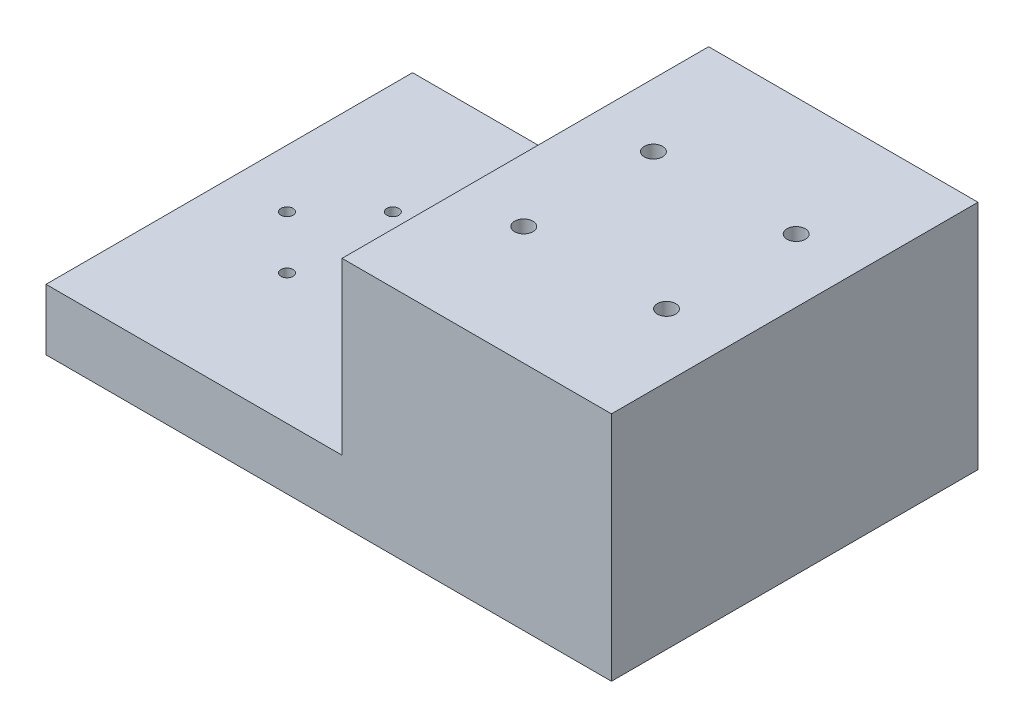
ISO-10303-21;
HEADER;
FILE_DESCRIPTION(('STEP AP214'),'2;1');
FILE_NAME('part.step','',(''),(''),'','','');
FILE_SCHEMA(('AUTOMOTIVE_DESIGN { 1 0 10303 214 1 1 1 1 }'));
ENDSEC;
DATA;
#1=APPLICATION_CONTEXT('core data for automotive mechanical design processes');
#2=APPLICATION_PROTOCOL_DEFINITION('international standard','automotive_design',2000,#1);
#3=PRODUCT_CONTEXT('',#1,'mechanical');
#4=PRODUCT('Part','Part','',(#3));
#5=PRODUCT_RELATED_PRODUCT_CATEGORY('part','',(#4));
#6=PRODUCT_DEFINITION_FORMATION('','',#4);
#7=PRODUCT_DEFINITION_CONTEXT('part definition',#1,'design');
#8=PRODUCT_DEFINITION('design','',#6,#7);
#9=PRODUCT_DEFINITION_SHAPE('','',#8);
#10=(LENGTH_UNIT() NAMED_UNIT(*) SI_UNIT(.MILLI.,.METRE.));
#11=(NAMED_UNIT(*) PLANE_ANGLE_UNIT() SI_UNIT($,.RADIAN.));
#12=(NAMED_UNIT(*) SI_UNIT($,.STERADIAN.) SOLID_ANGLE_UNIT());
#13=UNCERTAINTY_MEASURE_WITH_UNIT(LENGTH_MEASURE(1.E-05),#10,'distance_accuracy_value','');
#14=(GEOMETRIC_REPRESENTATION_CONTEXT(3) GLOBAL_UNCERTAINTY_ASSIGNED_CONTEXT((#13)) GLOBAL_UNIT_ASSIGNED_CONTEXT((#10,
#11,#12)) REPRESENTATION_CONTEXT('',''));
#15=CARTESIAN_POINT('',(0.,0.,0.));
#16=DIRECTION('',(0.,0.,1.));
#17=DIRECTION('',(1.,0.,0.));
#18=AXIS2_PLACEMENT_3D('',#15,#16,#17);
#19=CARTESIAN_POINT('',(0.,48.7038541550246,0.));
#20=DIRECTION('',(0.,1.,0.));
#21=DIRECTION('',(0.,0.,1.));
#22=AXIS2_PLACEMENT_3D('',#19,#20,#21);
#23=PLANE('',#22);
#24=CARTESIAN_POINT('',(104.375,48.7038541550246,13.4747));
#25=DIRECTION('',(0.,1.,0.));
#26=DIRECTION('',(0.,0.,1.));
#27=AXIS2_PLACEMENT_3D('',#24,#25,#26);
#28=CIRCLE('',#27,1.90500000000001);
#29=CARTESIAN_POINT('',(104.375,48.7038541550246,15.3797));
#30=VERTEX_POINT('',#29);
#31=EDGE_CURVE('E221',#30,#30,#28,.F.);
#32=ORIENTED_EDGE('',*,*,#31,.T.);
#33=EDGE_LOOP('',(#32));
#34=FACE_BOUND('',#33,.T.);
#35=CARTESIAN_POINT('',(74.695,48.7038541550246,-13.4747));
#36=DIRECTION('',(0.,1.,0.));
#37=DIRECTION('',(0.,0.,1.));
#38=AXIS2_PLACEMENT_3D('',#35,#36,#37);
#39=CIRCLE('',#38,1.90500000000001);
#40=CARTESIAN_POINT('',(74.695,48.7038541550246,-11.5697));
#41=VERTEX_POINT('',#40);
#42=EDGE_CURVE('E239',#41,#41,#39,.T.);
#43=ORIENTED_EDGE('',*,*,#42,.F.);
#44=EDGE_LOOP('',(#43));
#45=FACE_BOUND('',#44,.T.);
#46=CARTESIAN_POINT('',(104.375,48.7038541550246,-13.4747));
#47=DIRECTION('',(0.,1.,0.));
#48=DIRECTION('',(0.,0.,1.));
#49=AXIS2_PLACEMENT_3D('',#46,#47,#48);
#50=CIRCLE('',#49,1.90500000000001);
#51=CARTESIAN_POINT('',(104.375,48.7038541550246,-11.5697));
#52=VERTEX_POINT('',#51);
#53=EDGE_CURVE('E245',#52,#52,#50,.T.);
#54=ORIENTED_EDGE('',*,*,#53,.F.);
#55=EDGE_LOOP('',(#54));
#56=FACE_BOUND('',#55,.T.);
#57=DIRECTION('',(0.,0.,-1.));
#58=VECTOR('',#57,1.);
#59=CARTESIAN_POINT('',(117.55,48.7038541550246,38.1));
#60=LINE('',#59,#58);
#61=CARTESIAN_POINT('',(117.55,48.7038541550246,38.1));
#62=VERTEX_POINT('',#61);
#63=CARTESIAN_POINT('',(117.55,48.7038541550246,-38.1));
#64=VERTEX_POINT('',#63);
#65=EDGE_CURVE('E120',#62,#64,#60,.T.);
#66=ORIENTED_EDGE('',*,*,#65,.T.);
#67=DIRECTION('',(-1.,0.,0.));
#68=VECTOR('',#67,1.);
#69=CARTESIAN_POINT('',(117.55,48.7038541550246,-38.1));
#70=LINE('',#69,#68);
#71=CARTESIAN_POINT('',(61.55,48.7038541550246,-38.1));
#72=VERTEX_POINT('',#71);
#73=EDGE_CURVE('E161',#64,#72,#70,.T.);
#74=ORIENTED_EDGE('',*,*,#73,.T.);
#75=DIRECTION('',(0.,0.,1.));
#76=VECTOR('',#75,1.);
#77=CARTESIAN_POINT('',(61.55,48.7038541550246,38.1));
#78=LINE('',#77,#76);
#79=CARTESIAN_POINT('',(61.55,48.7038541550246,38.1));
#80=VERTEX_POINT('',#79);
#81=EDGE_CURVE('E167',#72,#80,#78,.T.);
#82=ORIENTED_EDGE('',*,*,#81,.T.);
#83=DIRECTION('',(1.,0.,0.));
#84=VECTOR('',#83,1.);
#85=CARTESIAN_POINT('',(117.55,48.7038541550246,38.1));
#86=LINE('',#85,#84);
#87=EDGE_CURVE('E126',#80,#62,#86,.T.);
#88=ORIENTED_EDGE('',*,*,#87,.T.);
#89=EDGE_LOOP('',(#66,#74,#82,#88));
#90=FACE_BOUND('',#89,.T.);
#91=CARTESIAN_POINT('',(74.695,48.7038541550246,13.4747));
#92=DIRECTION('',(0.,1.,0.));
#93=DIRECTION('',(0.,0.,1.));
#94=AXIS2_PLACEMENT_3D('',#91,#92,#93);
#95=CIRCLE('',#94,1.90500000000001);
#96=CARTESIAN_POINT('',(74.695,48.7038541550246,15.3797));
#97=VERTEX_POINT('',#96);
#98=EDGE_CURVE('E215',#97,#97,#95,.F.);
#99=ORIENTED_EDGE('',*,*,#98,.T.);
#100=EDGE_LOOP('',(#99));
#101=FACE_BOUND('',#100,.T.);
#102=ADVANCED_FACE('F35',(#34,#45,#56,#90,#101),#23,.T.);
#103=CARTESIAN_POINT('',(74.695,25.0538541550246,13.4747));
#104=DIRECTION('',(0.,1.,0.));
#105=DIRECTION('',(0.,0.,-1.));
#106=AXIS2_PLACEMENT_3D('',#103,#104,#105);
#107=PLANE('',#106);
#108=CARTESIAN_POINT('',(74.695,25.0538541550246,13.4747));
#109=DIRECTION('',(0.,-1.,0.));
#110=DIRECTION('',(0.,0.,-1.));
#111=AXIS2_PLACEMENT_3D('',#108,#109,#110);
#112=CIRCLE('',#111,3.75000000000001);
#113=CARTESIAN_POINT('',(74.695,25.0538541550246,9.72470000000001));
#114=VERTEX_POINT('',#113);
#115=EDGE_CURVE('E225',#114,#114,#112,.T.);
#116=ORIENTED_EDGE('',*,*,#115,.T.);
#117=EDGE_LOOP('',(#116));
#118=FACE_BOUND('',#117,.T.);
#119=CARTESIAN_POINT('',(74.695,25.0538541550246,13.4747));
#120=DIRECTION('',(0.,1.,0.));
#121=DIRECTION('',(0.,0.,1.));
#122=AXIS2_PLACEMENT_3D('',#119,#120,#121);
#123=CIRCLE('',#122,1.90500000000001);
#124=CARTESIAN_POINT('',(74.695,25.0538541550246,15.3797));
#125=VERTEX_POINT('',#124);
#126=EDGE_CURVE('E212',#125,#125,#123,.T.);
#127=ORIENTED_EDGE('',*,*,#126,.T.);
#128=EDGE_LOOP('',(#127));
#129=FACE_BOUND('',#128,.T.);
#130=ADVANCED_FACE('F277',(#118,#129),#107,.F.);
#131=CARTESIAN_POINT('',(104.375,25.0538541550246,13.4747));
#132=DIRECTION('',(0.,1.,0.));
#133=DIRECTION('',(0.,0.,-1.));
#134=AXIS2_PLACEMENT_3D('',#131,#132,#133);
#135=PLANE('',#134);
#136=CARTESIAN_POINT('',(104.375,25.0538541550246,13.4747));
#137=DIRECTION('',(0.,-1.,0.));
#138=DIRECTION('',(0.,0.,-1.));
#139=AXIS2_PLACEMENT_3D('',#136,#137,#138);
#140=CIRCLE('',#139,3.75000000000001);
#141=CARTESIAN_POINT('',(104.375,25.0538541550246,9.72470000000001));
#142=VERTEX_POINT('',#141);
#143=EDGE_CURVE('E231',#142,#142,#140,.T.);
#144=ORIENTED_EDGE('',*,*,#143,.T.);
#145=EDGE_LOOP('',(#144));
#146=FACE_BOUND('',#145,.T.);
#147=CARTESIAN_POINT('',(104.375,25.0538541550246,13.4747));
#148=DIRECTION('',(0.,1.,0.));
#149=DIRECTION('',(0.,0.,1.));
#150=AXIS2_PLACEMENT_3D('',#147,#148,#149);
#151=CIRCLE('',#150,1.90500000000001);
#152=CARTESIAN_POINT('',(104.375,25.0538541550246,15.3797));
#153=VERTEX_POINT('',#152);
#154=EDGE_CURVE('E218',#153,#153,#151,.T.);
#155=ORIENTED_EDGE('',*,*,#154,.T.);
#156=EDGE_LOOP('',(#155));
#157=FACE_BOUND('',#156,.T.);
#158=ADVANCED_FACE('F282',(#146,#157),#135,.F.);
#159=CARTESIAN_POINT('',(117.55,0.553854155024559,38.1));
#160=DIRECTION('',(0.,1.,0.));
#161=DIRECTION('',(0.,0.,1.));
#162=AXIS2_PLACEMENT_3D('',#159,#160,#161);
#163=PLANE('',#162);
#164=CARTESIAN_POINT('',(74.695,0.553854155024559,13.4747));
#165=DIRECTION('',(0.,-1.,0.));
#166=DIRECTION('',(0.,0.,-1.));
#167=AXIS2_PLACEMENT_3D('',#164,#165,#166);
#168=CIRCLE('',#167,3.75000000000001);
#169=CARTESIAN_POINT('',(74.695,0.553854155024559,9.72470000000001));
#170=VERTEX_POINT('',#169);
#171=EDGE_CURVE('E224',#170,#170,#168,.T.);
#172=ORIENTED_EDGE('',*,*,#171,.F.);
#173=EDGE_LOOP('',(#172));
#174=FACE_BOUND('',#173,.T.);
#175=CARTESIAN_POINT('',(104.375,0.553854155024559,13.4747));
#176=DIRECTION('',(0.,-1.,0.));
#177=DIRECTION('',(0.,0.,-1.));
#178=AXIS2_PLACEMENT_3D('',#175,#176,#177);
#179=CIRCLE('',#178,3.75000000000001);
#180=CARTESIAN_POINT('',(104.375,0.553854155024559,9.72470000000001));
#181=VERTEX_POINT('',#180);
#182=EDGE_CURVE('E228',#181,#181,#179,.T.);
#183=ORIENTED_EDGE('',*,*,#182,.F.);
#184=EDGE_LOOP('',(#183));
#185=FACE_BOUND('',#184,.T.);
#186=CARTESIAN_POINT('',(104.375,0.553854155024559,-13.4747));
#187=DIRECTION('',(0.,1.,0.));
#188=DIRECTION('',(0.,0.,1.));
#189=AXIS2_PLACEMENT_3D('',#186,#187,#188);
#190=CIRCLE('',#189,3.75000000000001);
#191=CARTESIAN_POINT('',(104.375,0.553854155024559,-9.72470000000001));
#192=VERTEX_POINT('',#191);
#193=EDGE_CURVE('E173',#192,#192,#190,.T.);
#194=ORIENTED_EDGE('',*,*,#193,.T.);
#195=EDGE_LOOP('',(#194));
#196=FACE_BOUND('',#195,.T.);
#197=CARTESIAN_POINT('',(12.,0.553854155024559,0.));
#198=DIRECTION('',(0.,1.,0.));
#199=DIRECTION('',(0.,0.,1.));
#200=AXIS2_PLACEMENT_3D('',#197,#198,#199);
#201=CIRCLE('',#200,1.25);
#202=CARTESIAN_POINT('',(12.,0.553854155024559,1.25));
#203=VERTEX_POINT('',#202);
#204=EDGE_CURVE('E131',#203,#203,#201,.T.);
#205=ORIENTED_EDGE('',*,*,#204,.T.);
#206=EDGE_LOOP('',(#205));
#207=FACE_BOUND('',#206,.T.);
#208=CARTESIAN_POINT('',(34.,0.553854155024559,0.));
#209=DIRECTION('',(0.,1.,0.));
#210=DIRECTION('',(0.,0.,1.));
#211=AXIS2_PLACEMENT_3D('',#208,#209,#210);
#212=CIRCLE('',#211,1.25);
#213=CARTESIAN_POINT('',(34.,0.553854155024559,1.25));
#214=VERTEX_POINT('',#213);
#215=EDGE_CURVE('E138',#214,#214,#212,.T.);
#216=ORIENTED_EDGE('',*,*,#215,.T.);
#217=EDGE_LOOP('',(#216));
#218=FACE_BOUND('',#217,.T.);
#219=CARTESIAN_POINT('',(23.,0.553854155024559,11.));
#220=DIRECTION('',(0.,1.,0.));
#221=DIRECTION('',(0.,0.,1.));
#222=AXIS2_PLACEMENT_3D('',#219,#220,#221);
#223=CIRCLE('',#222,1.25);
#224=CARTESIAN_POINT('',(23.,0.553854155024559,12.25));
#225=VERTEX_POINT('',#224);
#226=EDGE_CURVE('E144',#225,#225,#223,.T.);
#227=ORIENTED_EDGE('',*,*,#226,.T.);
#228=EDGE_LOOP('',(#227));
#229=FACE_BOUND('',#228,.T.);
#230=CARTESIAN_POINT('',(23.,0.553854155024559,-11.));
#231=DIRECTION('',(0.,1.,0.));
#232=DIRECTION('',(0.,0.,1.));
#233=AXIS2_PLACEMENT_3D('',#230,#231,#232);
#234=CIRCLE('',#233,1.25);
#235=CARTESIAN_POINT('',(23.,0.553854155024559,-9.75));
#236=VERTEX_POINT('',#235);
#237=EDGE_CURVE('E102',#236,#236,#234,.T.);
#238=ORIENTED_EDGE('',*,*,#237,.T.);
#239=EDGE_LOOP('',(#238));
#240=FACE_BOUND('',#239,.T.);
#241=DIRECTION('',(0.,0.,-1.));
#242=VECTOR('',#241,1.);
#243=CARTESIAN_POINT('',(0.,0.553854155024559,38.1));
#244=LINE('',#243,#242);
#245=CARTESIAN_POINT('',(0.,0.553854155024559,38.1));
#246=VERTEX_POINT('',#245);
#247=CARTESIAN_POINT('',(0.,0.553854155024559,-38.1));
#248=VERTEX_POINT('',#247);
#249=EDGE_CURVE('E101',#246,#248,#244,.T.);
#250=ORIENTED_EDGE('',*,*,#249,.T.);
#251=DIRECTION('',(-1.,0.,0.));
#252=VECTOR('',#251,1.);
#253=CARTESIAN_POINT('',(117.55,0.553854155024559,-38.1));
#254=LINE('',#253,#252);
#255=CARTESIAN_POINT('',(117.55,0.553854155024559,-38.1));
#256=VERTEX_POINT('',#255);
#257=EDGE_CURVE('E44',#256,#248,#254,.T.);
#258=ORIENTED_EDGE('',*,*,#257,.F.);
#259=DIRECTION('',(0.,0.,-1.));
#260=VECTOR('',#259,1.);
#261=CARTESIAN_POINT('',(117.55,0.553854155024559,38.1));
#262=LINE('',#261,#260);
#263=CARTESIAN_POINT('',(117.55,0.553854155024559,38.1));
#264=VERTEX_POINT('',#263);
#265=EDGE_CURVE('E61',#264,#256,#262,.T.);
#266=ORIENTED_EDGE('',*,*,#265,.F.);
#267=DIRECTION('',(-1.,0.,0.));
#268=VECTOR('',#267,1.);
#269=CARTESIAN_POINT('',(117.55,0.553854155024559,38.1));
#270=LINE('',#269,#268);
#271=EDGE_CURVE('E12',#264,#246,#270,.T.);
#272=ORIENTED_EDGE('',*,*,#271,.T.);
#273=EDGE_LOOP('',(#250,#258,#266,#272));
#274=FACE_BOUND('',#273,.T.);
#275=CARTESIAN_POINT('',(74.695,0.553854155024559,-13.4747));
#276=DIRECTION('',(0.,1.,0.));
#277=DIRECTION('',(0.,0.,1.));
#278=AXIS2_PLACEMENT_3D('',#275,#276,#277);
#279=CIRCLE('',#278,3.75000000000001);
#280=CARTESIAN_POINT('',(74.695,0.553854155024559,-9.72470000000001));
#281=VERTEX_POINT('',#280);
#282=EDGE_CURVE('E248',#281,#281,#279,.T.);
#283=ORIENTED_EDGE('',*,*,#282,.T.);
#284=EDGE_LOOP('',(#283));
#285=FACE_BOUND('',#284,.T.);
#286=ADVANCED_FACE('F259',(#174,#185,#196,#207,#218,#229,#240,#274,#285),#163,.F.);
#287=CARTESIAN_POINT('',(117.55,13.2538541550246,38.1));
#288=DIRECTION('',(0.,-1.,0.));
#289=DIRECTION('',(0.,0.,-1.));
#290=AXIS2_PLACEMENT_3D('',#287,#288,#289);
#291=PLANE('',#290);
#292=CARTESIAN_POINT('',(23.,13.2538541550246,-11.));
#293=DIRECTION('',(0.,1.,0.));
#294=DIRECTION('',(0.,0.,1.));
#295=AXIS2_PLACEMENT_3D('',#292,#293,#294);
#296=CIRCLE('',#295,1.24999999999999);
#297=CARTESIAN_POINT('',(23.,13.2538541550246,-9.75000000000001));
#298=VERTEX_POINT('',#297);
#299=EDGE_CURVE('E106',#298,#298,#296,.T.);
#300=ORIENTED_EDGE('',*,*,#299,.F.);
#301=EDGE_LOOP('',(#300));
#302=FACE_BOUND('',#301,.T.);
#303=CARTESIAN_POINT('',(23.,13.2538541550246,11.));
#304=DIRECTION('',(0.,1.,0.));
#305=DIRECTION('',(0.,0.,1.));
#306=AXIS2_PLACEMENT_3D('',#303,#304,#305);
#307=CIRCLE('',#306,1.24999999999999);
#308=CARTESIAN_POINT('',(23.,13.2538541550246,12.25));
#309=VERTEX_POINT('',#308);
#310=EDGE_CURVE('E141',#309,#309,#307,.T.);
#311=ORIENTED_EDGE('',*,*,#310,.F.);
#312=EDGE_LOOP('',(#311));
#313=FACE_BOUND('',#312,.T.);
#314=CARTESIAN_POINT('',(34.,13.2538541550246,0.));
#315=DIRECTION('',(0.,1.,0.));
#316=DIRECTION('',(0.,0.,1.));
#317=AXIS2_PLACEMENT_3D('',#314,#315,#316);
#318=CIRCLE('',#317,1.24999999999999);
#319=CARTESIAN_POINT('',(34.,13.2538541550246,1.24999999999999));
#320=VERTEX_POINT('',#319);
#321=EDGE_CURVE('E135',#320,#320,#318,.T.);
#322=ORIENTED_EDGE('',*,*,#321,.F.);
#323=EDGE_LOOP('',(#322));
#324=FACE_BOUND('',#323,.T.);
#325=CARTESIAN_POINT('',(12.,13.2538541550246,0.));
#326=DIRECTION('',(0.,1.,0.));
#327=DIRECTION('',(0.,0.,1.));
#328=AXIS2_PLACEMENT_3D('',#325,#326,#327);
#329=CIRCLE('',#328,1.24999999999999);
#330=CARTESIAN_POINT('',(12.,13.2538541550246,1.24999999999999));
#331=VERTEX_POINT('',#330);
#332=EDGE_CURVE('E128',#331,#331,#329,.T.);
#333=ORIENTED_EDGE('',*,*,#332,.F.);
#334=EDGE_LOOP('',(#333));
#335=FACE_BOUND('',#334,.T.);
#336=DIRECTION('',(0.,0.,1.));
#337=VECTOR('',#336,1.);
#338=CARTESIAN_POINT('',(61.55,13.2538541550246,38.1));
#339=LINE('',#338,#337);
#340=CARTESIAN_POINT('',(61.55,13.2538541550246,-38.1));
#341=VERTEX_POINT('',#340);
#342=CARTESIAN_POINT('',(61.55,13.2538541550246,38.1));
#343=VERTEX_POINT('',#342);
#344=EDGE_CURVE('E52',#341,#343,#339,.T.);
#345=ORIENTED_EDGE('',*,*,#344,.F.);
#346=DIRECTION('',(-1.,0.,0.));
#347=VECTOR('',#346,1.);
#348=CARTESIAN_POINT('',(117.55,13.2538541550246,-38.1));
#349=LINE('',#348,#347);
#350=CARTESIAN_POINT('',(0.,13.2538541550246,-38.1));
#351=VERTEX_POINT('',#350);
#352=EDGE_CURVE('E88',#341,#351,#349,.T.);
#353=ORIENTED_EDGE('',*,*,#352,.T.);
#354=DIRECTION('',(0.,0.,1.));
#355=VECTOR('',#354,1.);
#356=CARTESIAN_POINT('',(0.,13.2538541550246,38.1));
#357=LINE('',#356,#355);
#358=CARTESIAN_POINT('',(0.,13.2538541550246,38.1));
#359=VERTEX_POINT('',#358);
#360=EDGE_CURVE('E92',#351,#359,#357,.T.);
#361=ORIENTED_EDGE('',*,*,#360,.T.);
#362=DIRECTION('',(-1.,0.,0.));
#363=VECTOR('',#362,1.);
#364=CARTESIAN_POINT('',(117.55,13.2538541550246,38.1));
#365=LINE('',#364,#363);
#366=EDGE_CURVE('E79',#343,#359,#365,.T.);
#367=ORIENTED_EDGE('',*,*,#366,.F.);
#368=EDGE_LOOP('',(#345,#353,#361,#367));
#369=FACE_BOUND('',#368,.T.);
#370=ADVANCED_FACE('F93',(#302,#313,#324,#335,#369),#291,.F.);
#371=CARTESIAN_POINT('',(117.55,0.553854155024559,38.1));
#372=DIRECTION('',(0.,0.,-1.));
#373=DIRECTION('',(-1.,0.,0.));
#374=AXIS2_PLACEMENT_3D('',#371,#372,#373);
#375=PLANE('',#374);
#376=DIRECTION('',(0.,-1.,0.));
#377=VECTOR('',#376,1.);
#378=CARTESIAN_POINT('',(0.,0.553854155024559,38.1));
#379=LINE('',#378,#377);
#380=EDGE_CURVE('E83',#359,#246,#379,.T.);
#381=ORIENTED_EDGE('',*,*,#380,.T.);
#382=ORIENTED_EDGE('',*,*,#271,.F.);
#383=DIRECTION('',(0.,-1.,0.));
#384=VECTOR('',#383,1.);
#385=CARTESIAN_POINT('',(117.55,0.553854155024559,38.1));
#386=LINE('',#385,#384);
#387=EDGE_CURVE('E97',#62,#264,#386,.T.);
#388=ORIENTED_EDGE('',*,*,#387,.F.);
#389=ORIENTED_EDGE('',*,*,#87,.F.);
#390=DIRECTION('',(0.,-1.,0.));
#391=VECTOR('',#390,1.);
#392=CARTESIAN_POINT('',(61.55,48.7038541550246,38.1));
#393=LINE('',#392,#391);
#394=EDGE_CURVE('E87',#80,#343,#393,.T.);
#395=ORIENTED_EDGE('',*,*,#394,.T.);
#396=ORIENTED_EDGE('',*,*,#366,.T.);
#397=EDGE_LOOP('',(#381,#382,#388,#389,#395,#396));
#398=FACE_BOUND('',#397,.T.);
#399=ADVANCED_FACE('F37',(#398),#375,.F.);
#400=CARTESIAN_POINT('',(117.55,0.553854155024559,-38.1));
#401=DIRECTION('',(0.,0.,1.));
#402=DIRECTION('',(1.,0.,0.));
#403=AXIS2_PLACEMENT_3D('',#400,#401,#402);
#404=PLANE('',#403);
#405=DIRECTION('',(0.,1.,0.));
#406=VECTOR('',#405,1.);
#407=CARTESIAN_POINT('',(0.,0.553854155024559,-38.1));
#408=LINE('',#407,#406);
#409=EDGE_CURVE('E98',#248,#351,#408,.T.);
#410=ORIENTED_EDGE('',*,*,#409,.T.);
#411=ORIENTED_EDGE('',*,*,#352,.F.);
#412=DIRECTION('',(0.,-1.,0.));
#413=VECTOR('',#412,1.);
#414=CARTESIAN_POINT('',(61.55,48.7038541550246,-38.1));
#415=LINE('',#414,#413);
#416=EDGE_CURVE('E132',#72,#341,#415,.T.);
#417=ORIENTED_EDGE('',*,*,#416,.F.);
#418=ORIENTED_EDGE('',*,*,#73,.F.);
#419=DIRECTION('',(0.,1.,0.));
#420=VECTOR('',#419,1.);
#421=CARTESIAN_POINT('',(117.55,0.553854155024559,-38.1));
#422=LINE('',#421,#420);
#423=EDGE_CURVE('E89',#256,#64,#422,.T.);
#424=ORIENTED_EDGE('',*,*,#423,.F.);
#425=ORIENTED_EDGE('',*,*,#257,.T.);
#426=EDGE_LOOP('',(#410,#411,#417,#418,#424,#425));
#427=FACE_BOUND('',#426,.T.);
#428=ADVANCED_FACE('F162',(#427),#404,.F.);
#429=CARTESIAN_POINT('',(117.55,0.,0.));
#430=DIRECTION('',(-1.,0.,0.));
#431=DIRECTION('',(0.,0.,1.));
#432=AXIS2_PLACEMENT_3D('',#429,#430,#431);
#433=PLANE('',#432);
#434=ORIENTED_EDGE('',*,*,#387,.T.);
#435=ORIENTED_EDGE('',*,*,#265,.T.);
#436=ORIENTED_EDGE('',*,*,#423,.T.);
#437=ORIENTED_EDGE('',*,*,#65,.F.);
#438=EDGE_LOOP('',(#434,#435,#436,#437));
#439=FACE_BOUND('',#438,.T.);
#440=ADVANCED_FACE('F153',(#439),#433,.F.);
#441=CARTESIAN_POINT('',(0.,0.,0.));
#442=DIRECTION('',(-1.,0.,0.));
#443=DIRECTION('',(0.,0.,1.));
#444=AXIS2_PLACEMENT_3D('',#441,#442,#443);
#445=PLANE('',#444);
#446=CARTESIAN_POINT('',(0.,6.90385415502456,-12.7));
#447=DIRECTION('',(-1.,0.,0.));
#448=DIRECTION('',(0.,0.,1.));
#449=AXIS2_PLACEMENT_3D('',#446,#447,#448);
#450=CIRCLE('',#449,1.02499999999999);
#451=CARTESIAN_POINT('',(0.,6.90385415502456,-11.675));
#452=VERTEX_POINT('',#451);
#453=EDGE_CURVE('E202',#452,#452,#450,.T.);
#454=ORIENTED_EDGE('',*,*,#453,.F.);
#455=EDGE_LOOP('',(#454));
#456=FACE_BOUND('',#455,.T.);
#457=CARTESIAN_POINT('',(0.,6.90385415502456,12.7));
#458=DIRECTION('',(-1.,0.,0.));
#459=DIRECTION('',(0.,0.,1.));
#460=AXIS2_PLACEMENT_3D('',#457,#458,#459);
#461=CIRCLE('',#460,1.02499999999999);
#462=CARTESIAN_POINT('',(0.,6.90385415502456,13.725));
#463=VERTEX_POINT('',#462);
#464=EDGE_CURVE('E201',#463,#463,#461,.T.);
#465=ORIENTED_EDGE('',*,*,#464,.F.);
#466=EDGE_LOOP('',(#465));
#467=FACE_BOUND('',#466,.T.);
#468=ORIENTED_EDGE('',*,*,#380,.F.);
#469=ORIENTED_EDGE('',*,*,#360,.F.);
#470=ORIENTED_EDGE('',*,*,#409,.F.);
#471=ORIENTED_EDGE('',*,*,#249,.F.);
#472=EDGE_LOOP('',(#468,#469,#470,#471));
#473=FACE_BOUND('',#472,.T.);
#474=ADVANCED_FACE('F100',(#456,#467,#473),#445,.T.);
#475=CARTESIAN_POINT('',(23.,13.2538541550246,-11.));
#476=DIRECTION('',(0.,1.,0.));
#477=DIRECTION('',(0.,0.,1.));
#478=AXIS2_PLACEMENT_3D('',#475,#476,#477);
#479=CYLINDRICAL_SURFACE('',#478,1.24999999999999);
#480=ORIENTED_EDGE('',*,*,#237,.F.);
#481=EDGE_LOOP('',(#480));
#482=FACE_BOUND('',#481,.T.);
#483=ORIENTED_EDGE('',*,*,#299,.T.);
#484=EDGE_LOOP('',(#483));
#485=FACE_BOUND('',#484,.T.);
#486=ADVANCED_FACE('F297',(#482,#485),#479,.F.);
#487=CARTESIAN_POINT('',(23.,13.2538541550246,11.));
#488=DIRECTION('',(0.,1.,0.));
#489=DIRECTION('',(0.,0.,1.));
#490=AXIS2_PLACEMENT_3D('',#487,#488,#489);
#491=CYLINDRICAL_SURFACE('',#490,1.24999999999999);
#492=ORIENTED_EDGE('',*,*,#226,.F.);
#493=EDGE_LOOP('',(#492));
#494=FACE_BOUND('',#493,.T.);
#495=ORIENTED_EDGE('',*,*,#310,.T.);
#496=EDGE_LOOP('',(#495));
#497=FACE_BOUND('',#496,.T.);
#498=ADVANCED_FACE('F293',(#494,#497),#491,.F.);
#499=CARTESIAN_POINT('',(34.,13.2538541550246,0.));
#500=DIRECTION('',(0.,1.,0.));
#501=DIRECTION('',(0.,0.,1.));
#502=AXIS2_PLACEMENT_3D('',#499,#500,#501);
#503=CYLINDRICAL_SURFACE('',#502,1.24999999999999);
#504=ORIENTED_EDGE('',*,*,#215,.F.);
#505=EDGE_LOOP('',(#504));
#506=FACE_BOUND('',#505,.T.);
#507=ORIENTED_EDGE('',*,*,#321,.T.);
#508=EDGE_LOOP('',(#507));
#509=FACE_BOUND('',#508,.T.);
#510=ADVANCED_FACE('F289',(#506,#509),#503,.F.);
#511=CARTESIAN_POINT('',(12.,13.2538541550246,0.));
#512=DIRECTION('',(0.,1.,0.));
#513=DIRECTION('',(0.,0.,1.));
#514=AXIS2_PLACEMENT_3D('',#511,#512,#513);
#515=CYLINDRICAL_SURFACE('',#514,1.24999999999999);
#516=ORIENTED_EDGE('',*,*,#204,.F.);
#517=EDGE_LOOP('',(#516));
#518=FACE_BOUND('',#517,.T.);
#519=ORIENTED_EDGE('',*,*,#332,.T.);
#520=EDGE_LOOP('',(#519));
#521=FACE_BOUND('',#520,.T.);
#522=ADVANCED_FACE('F273',(#518,#521),#515,.F.);
#523=CARTESIAN_POINT('',(61.55,48.7038541550246,38.1));
#524=DIRECTION('',(1.,0.,0.));
#525=DIRECTION('',(0.,0.,-1.));
#526=AXIS2_PLACEMENT_3D('',#523,#524,#525);
#527=PLANE('',#526);
#528=ORIENTED_EDGE('',*,*,#344,.T.);
#529=ORIENTED_EDGE('',*,*,#394,.F.);
#530=ORIENTED_EDGE('',*,*,#81,.F.);
#531=ORIENTED_EDGE('',*,*,#416,.T.);
#532=EDGE_LOOP('',(#528,#529,#530,#531));
#533=FACE_BOUND('',#532,.T.);
#534=ADVANCED_FACE('F178',(#533),#527,.F.);
#535=CARTESIAN_POINT('',(104.375,25.0538541550246,-13.4747));
#536=DIRECTION('',(0.,-1.,0.));
#537=DIRECTION('',(0.,0.,-1.));
#538=AXIS2_PLACEMENT_3D('',#535,#536,#537);
#539=CYLINDRICAL_SURFACE('',#538,3.75000000000001);
#540=CARTESIAN_POINT('',(104.375,25.0538541550246,-13.4747));
#541=DIRECTION('',(0.,1.,0.));
#542=DIRECTION('',(0.,0.,1.));
#543=AXIS2_PLACEMENT_3D('',#540,#541,#542);
#544=CIRCLE('',#543,3.75000000000001);
#545=CARTESIAN_POINT('',(104.375,25.0538541550246,-9.72470000000001));
#546=VERTEX_POINT('',#545);
#547=EDGE_CURVE('E121',#546,#546,#544,.T.);
#548=ORIENTED_EDGE('',*,*,#547,.T.);
#549=EDGE_LOOP('',(#548));
#550=FACE_BOUND('',#549,.T.);
#551=ORIENTED_EDGE('',*,*,#193,.F.);
#552=EDGE_LOOP('',(#551));
#553=FACE_BOUND('',#552,.T.);
#554=ADVANCED_FACE('F262',(#550,#553),#539,.F.);
#555=CARTESIAN_POINT('',(104.375,25.0538541550246,-13.4747));
#556=DIRECTION('',(0.,1.,0.));
#557=DIRECTION('',(0.,0.,1.));
#558=AXIS2_PLACEMENT_3D('',#555,#556,#557);
#559=PLANE('',#558);
#560=CARTESIAN_POINT('',(104.375,25.0538541550246,-13.4747));
#561=DIRECTION('',(0.,-1.,0.));
#562=DIRECTION('',(0.,0.,-1.));
#563=AXIS2_PLACEMENT_3D('',#560,#561,#562);
#564=CIRCLE('',#563,1.90500000000001);
#565=CARTESIAN_POINT('',(104.375,25.0538541550246,-15.3797));
#566=VERTEX_POINT('',#565);
#567=EDGE_CURVE('E242',#566,#566,#564,.T.);
#568=ORIENTED_EDGE('',*,*,#567,.F.);
#569=EDGE_LOOP('',(#568));
#570=FACE_BOUND('',#569,.T.);
#571=ORIENTED_EDGE('',*,*,#547,.F.);
#572=EDGE_LOOP('',(#571));
#573=FACE_BOUND('',#572,.T.);
#574=ADVANCED_FACE('F264',(#570,#573),#559,.F.);
#575=CARTESIAN_POINT('',(74.695,25.0538541550246,-13.4747));
#576=DIRECTION('',(0.,-1.,0.));
#577=DIRECTION('',(0.,0.,-1.));
#578=AXIS2_PLACEMENT_3D('',#575,#576,#577);
#579=CYLINDRICAL_SURFACE('',#578,3.75000000000001);
#580=CARTESIAN_POINT('',(74.695,25.0538541550246,-13.4747));
#581=DIRECTION('',(0.,1.,0.));
#582=DIRECTION('',(0.,0.,1.));
#583=AXIS2_PLACEMENT_3D('',#580,#581,#582);
#584=CIRCLE('',#583,3.75000000000001);
#585=CARTESIAN_POINT('',(74.695,25.0538541550246,-9.72470000000001));
#586=VERTEX_POINT('',#585);
#587=EDGE_CURVE('E249',#586,#586,#584,.T.);
#588=ORIENTED_EDGE('',*,*,#587,.T.);
#589=EDGE_LOOP('',(#588));
#590=FACE_BOUND('',#589,.T.);
#591=ORIENTED_EDGE('',*,*,#282,.F.);
#592=EDGE_LOOP('',(#591));
#593=FACE_BOUND('',#592,.T.);
#594=ADVANCED_FACE('F270',(#590,#593),#579,.F.);
#595=CARTESIAN_POINT('',(74.695,25.0538541550246,-13.4747));
#596=DIRECTION('',(0.,1.,0.));
#597=DIRECTION('',(0.,0.,1.));
#598=AXIS2_PLACEMENT_3D('',#595,#596,#597);
#599=PLANE('',#598);
#600=CARTESIAN_POINT('',(74.695,25.0538541550246,-13.4747));
#601=DIRECTION('',(0.,-1.,0.));
#602=DIRECTION('',(0.,0.,-1.));
#603=AXIS2_PLACEMENT_3D('',#600,#601,#602);
#604=CIRCLE('',#603,1.90500000000001);
#605=CARTESIAN_POINT('',(74.695,25.0538541550246,-15.3797));
#606=VERTEX_POINT('',#605);
#607=EDGE_CURVE('E234',#606,#606,#604,.T.);
#608=ORIENTED_EDGE('',*,*,#607,.F.);
#609=EDGE_LOOP('',(#608));
#610=FACE_BOUND('',#609,.T.);
#611=ORIENTED_EDGE('',*,*,#587,.F.);
#612=EDGE_LOOP('',(#611));
#613=FACE_BOUND('',#612,.T.);
#614=ADVANCED_FACE('F342',(#610,#613),#599,.F.);
#615=CARTESIAN_POINT('',(104.375,48.7038791550246,-13.4747));
#616=DIRECTION('',(0.,-1.,0.));
#617=DIRECTION('',(0.,0.,-1.));
#618=AXIS2_PLACEMENT_3D('',#615,#616,#617);
#619=CYLINDRICAL_SURFACE('',#618,1.90500000000001);
#620=ORIENTED_EDGE('',*,*,#53,.T.);
#621=EDGE_LOOP('',(#620));
#622=FACE_BOUND('',#621,.T.);
#623=ORIENTED_EDGE('',*,*,#567,.T.);
#624=EDGE_LOOP('',(#623));
#625=FACE_BOUND('',#624,.T.);
#626=ADVANCED_FACE('F335',(#622,#625),#619,.F.);
#627=CARTESIAN_POINT('',(74.695,48.7038791550246,-13.4747));
#628=DIRECTION('',(0.,-1.,0.));
#629=DIRECTION('',(0.,0.,-1.));
#630=AXIS2_PLACEMENT_3D('',#627,#628,#629);
#631=CYLINDRICAL_SURFACE('',#630,1.90500000000001);
#632=ORIENTED_EDGE('',*,*,#42,.T.);
#633=EDGE_LOOP('',(#632));
#634=FACE_BOUND('',#633,.T.);
#635=ORIENTED_EDGE('',*,*,#607,.T.);
#636=EDGE_LOOP('',(#635));
#637=FACE_BOUND('',#636,.T.);
#638=ADVANCED_FACE('F325',(#634,#637),#631,.F.);
#639=CARTESIAN_POINT('',(104.375,25.0538541550246,13.4747));
#640=DIRECTION('',(0.,-1.,0.));
#641=DIRECTION('',(0.,0.,-1.));
#642=AXIS2_PLACEMENT_3D('',#639,#640,#641);
#643=CYLINDRICAL_SURFACE('',#642,3.75000000000001);
#644=ORIENTED_EDGE('',*,*,#143,.F.);
#645=EDGE_LOOP('',(#644));
#646=FACE_BOUND('',#645,.T.);
#647=ORIENTED_EDGE('',*,*,#182,.T.);
#648=EDGE_LOOP('',(#647));
#649=FACE_BOUND('',#648,.T.);
#650=ADVANCED_FACE('F322',(#646,#649),#643,.F.);
#651=CARTESIAN_POINT('',(74.695,25.0538541550246,13.4747));
#652=DIRECTION('',(0.,-1.,0.));
#653=DIRECTION('',(0.,0.,-1.));
#654=AXIS2_PLACEMENT_3D('',#651,#652,#653);
#655=CYLINDRICAL_SURFACE('',#654,3.75000000000001);
#656=ORIENTED_EDGE('',*,*,#115,.F.);
#657=EDGE_LOOP('',(#656));
#658=FACE_BOUND('',#657,.T.);
#659=ORIENTED_EDGE('',*,*,#171,.T.);
#660=EDGE_LOOP('',(#659));
#661=FACE_BOUND('',#660,.T.);
#662=ADVANCED_FACE('F324',(#658,#661),#655,.F.);
#663=CARTESIAN_POINT('',(104.375,48.7038791550246,13.4747));
#664=DIRECTION('',(0.,-1.,0.));
#665=DIRECTION('',(0.,0.,-1.));
#666=AXIS2_PLACEMENT_3D('',#663,#664,#665);
#667=CYLINDRICAL_SURFACE('',#666,1.90500000000001);
#668=ORIENTED_EDGE('',*,*,#31,.F.);
#669=EDGE_LOOP('',(#668));
#670=FACE_BOUND('',#669,.T.);
#671=ORIENTED_EDGE('',*,*,#154,.F.);
#672=EDGE_LOOP('',(#671));
#673=FACE_BOUND('',#672,.T.);
#674=ADVANCED_FACE('F332',(#670,#673),#667,.F.);
#675=CARTESIAN_POINT('',(74.695,48.7038791550246,13.4747));
#676=DIRECTION('',(0.,-1.,0.));
#677=DIRECTION('',(0.,0.,-1.));
#678=AXIS2_PLACEMENT_3D('',#675,#676,#677);
#679=CYLINDRICAL_SURFACE('',#678,1.90500000000001);
#680=ORIENTED_EDGE('',*,*,#98,.F.);
#681=EDGE_LOOP('',(#680));
#682=FACE_BOUND('',#681,.T.);
#683=ORIENTED_EDGE('',*,*,#126,.F.);
#684=EDGE_LOOP('',(#683));
#685=FACE_BOUND('',#684,.T.);
#686=ADVANCED_FACE('F411',(#682,#685),#679,.F.);
#687=CARTESIAN_POINT('',(8.3,6.90385415502456,12.7));
#688=DIRECTION('',(-1.,0.,0.));
#689=DIRECTION('',(0.,0.,1.));
#690=AXIS2_PLACEMENT_3D('',#687,#688,#689);
#691=CONICAL_SURFACE('',#690,1.025,1.02974425867665);
#692=CARTESIAN_POINT('',(8.91588213450325,6.90385415502456,12.7));
#693=VERTEX_POINT('',#692);
#694=VERTEX_LOOP('',#693);
#695=FACE_BOUND('',#694,.T.);
#696=CARTESIAN_POINT('',(8.3,6.90385415502456,12.7));
#697=DIRECTION('',(-1.,0.,0.));
#698=DIRECTION('',(0.,0.,1.));
#699=AXIS2_PLACEMENT_3D('',#696,#697,#698);
#700=CIRCLE('',#699,1.025);
#701=CARTESIAN_POINT('',(8.3,6.90385415502456,13.725));
#702=VERTEX_POINT('',#701);
#703=EDGE_CURVE('E205',#702,#702,#700,.T.);
#704=ORIENTED_EDGE('',*,*,#703,.T.);
#705=EDGE_LOOP('',(#704));
#706=FACE_BOUND('',#705,.T.);
#707=ADVANCED_FACE('F421',(#695,#706),#691,.F.);
#708=CARTESIAN_POINT('',(0.,6.90385415502456,12.7));
#709=DIRECTION('',(-1.,0.,0.));
#710=DIRECTION('',(0.,0.,1.));
#711=AXIS2_PLACEMENT_3D('',#708,#709,#710);
#712=CYLINDRICAL_SURFACE('',#711,1.02499999999999);
#713=ORIENTED_EDGE('',*,*,#703,.F.);
#714=EDGE_LOOP('',(#713));
#715=FACE_BOUND('',#714,.T.);
#716=ORIENTED_EDGE('',*,*,#464,.T.);
#717=EDGE_LOOP('',(#716));
#718=FACE_BOUND('',#717,.T.);
#719=ADVANCED_FACE('F195',(#715,#718),#712,.F.);
#720=CARTESIAN_POINT('',(8.3,6.90385415502456,-12.7));
#721=DIRECTION('',(-1.,0.,0.));
#722=DIRECTION('',(0.,0.,1.));
#723=AXIS2_PLACEMENT_3D('',#720,#721,#722);
#724=CONICAL_SURFACE('',#723,1.025,1.02974425867665);
#725=CARTESIAN_POINT('',(8.91588213450325,6.90385415502456,-12.7));
#726=VERTEX_POINT('',#725);
#727=VERTEX_LOOP('',#726);
#728=FACE_BOUND('',#727,.T.);
#729=CARTESIAN_POINT('',(8.3,6.90385415502456,-12.7));
#730=DIRECTION('',(-1.,0.,0.));
#731=DIRECTION('',(0.,0.,1.));
#732=AXIS2_PLACEMENT_3D('',#729,#730,#731);
#733=CIRCLE('',#732,1.025);
#734=CARTESIAN_POINT('',(8.3,6.90385415502456,-11.675));
#735=VERTEX_POINT('',#734);
#736=EDGE_CURVE('E199',#735,#735,#733,.T.);
#737=ORIENTED_EDGE('',*,*,#736,.T.);
#738=EDGE_LOOP('',(#737));
#739=FACE_BOUND('',#738,.T.);
#740=ADVANCED_FACE('F191',(#728,#739),#724,.F.);
#741=CARTESIAN_POINT('',(0.,6.90385415502456,-12.7));
#742=DIRECTION('',(-1.,0.,0.));
#743=DIRECTION('',(0.,0.,1.));
#744=AXIS2_PLACEMENT_3D('',#741,#742,#743);
#745=CYLINDRICAL_SURFACE('',#744,1.02499999999999);
#746=ORIENTED_EDGE('',*,*,#736,.F.);
#747=EDGE_LOOP('',(#746));
#748=FACE_BOUND('',#747,.T.);
#749=ORIENTED_EDGE('',*,*,#453,.T.);
#750=EDGE_LOOP('',(#749));
#751=FACE_BOUND('',#750,.T.);
#752=ADVANCED_FACE('F194',(#748,#751),#745,.F.);
#753=CLOSED_SHELL('',(#102,#130,#158,#286,#370,#399,#428,#440,#474,#486,#498,#510,#522,#534,
#554,#574,#594,#614,#626,#638,#650,#662,#674,#686,#707,#719,#740,#752));
#754=MANIFOLD_SOLID_BREP('B2',#753);
#755=ADVANCED_BREP_SHAPE_REPRESENTATION('',(#18,#754),#14);
#756=SHAPE_DEFINITION_REPRESENTATION(#9,#755);
ENDSEC;
END-ISO-10303-21;
